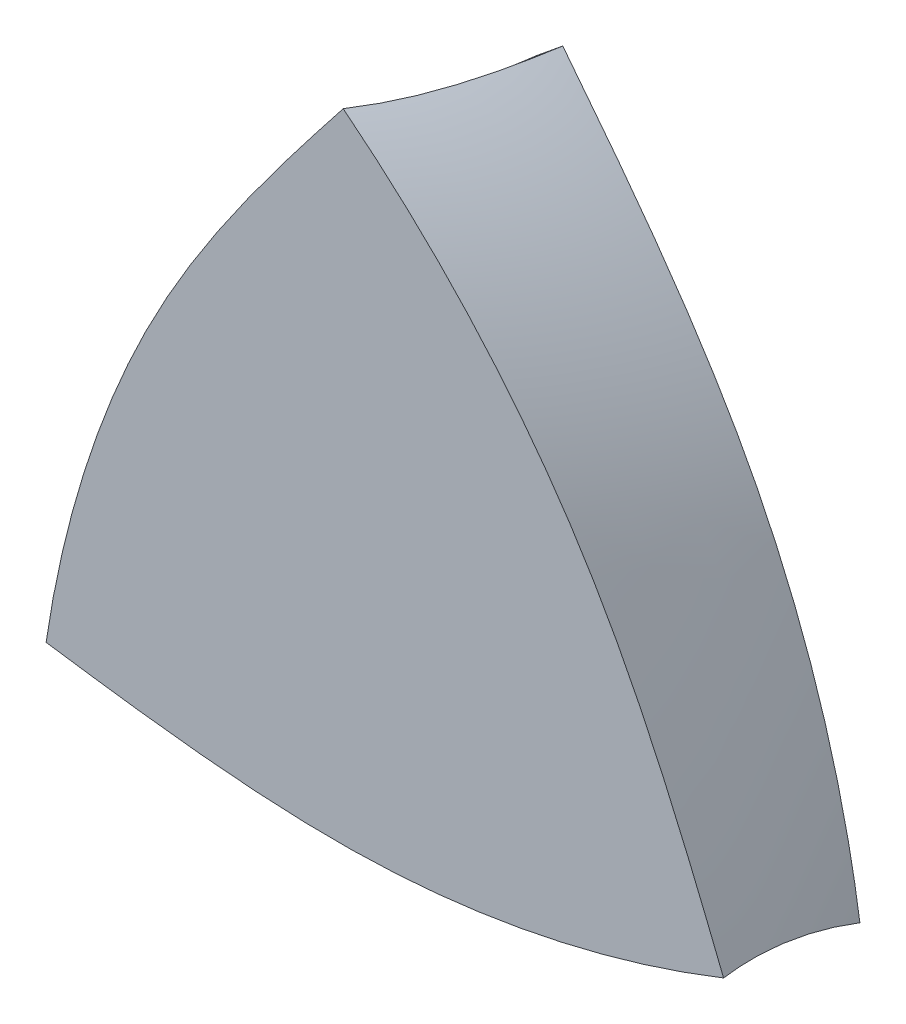
ISO-10303-21;
HEADER;
FILE_DESCRIPTION(('STEP AP214'),'2;1');
FILE_NAME('part.step','',(''),(''),'','','');
FILE_SCHEMA(('AUTOMOTIVE_DESIGN { 1 0 10303 214 1 1 1 1 }'));
ENDSEC;
DATA;
#1=APPLICATION_CONTEXT('core data for automotive mechanical design processes');
#2=APPLICATION_PROTOCOL_DEFINITION('international standard','automotive_design',2000,#1);
#3=PRODUCT_CONTEXT('',#1,'mechanical');
#4=PRODUCT('Part','Part','',(#3));
#5=PRODUCT_RELATED_PRODUCT_CATEGORY('part','',(#4));
#6=PRODUCT_DEFINITION_FORMATION('','',#4);
#7=PRODUCT_DEFINITION_CONTEXT('part definition',#1,'design');
#8=PRODUCT_DEFINITION('design','',#6,#7);
#9=PRODUCT_DEFINITION_SHAPE('','',#8);
#10=(LENGTH_UNIT() NAMED_UNIT(*) SI_UNIT(.MILLI.,.METRE.));
#11=(NAMED_UNIT(*) PLANE_ANGLE_UNIT() SI_UNIT($,.RADIAN.));
#12=(NAMED_UNIT(*) SI_UNIT($,.STERADIAN.) SOLID_ANGLE_UNIT());
#13=UNCERTAINTY_MEASURE_WITH_UNIT(LENGTH_MEASURE(1.E-05),#10,'distance_accuracy_value','');
#14=(GEOMETRIC_REPRESENTATION_CONTEXT(3) GLOBAL_UNCERTAINTY_ASSIGNED_CONTEXT((#13)) GLOBAL_UNIT_ASSIGNED_CONTEXT((#10,
#11,#12)) REPRESENTATION_CONTEXT('',''));
#15=CARTESIAN_POINT('',(0.,0.,0.));
#16=DIRECTION('',(0.,0.,1.));
#17=DIRECTION('',(1.,0.,0.));
#18=AXIS2_PLACEMENT_3D('',#15,#16,#17);
#19=CARTESIAN_POINT('',(43.6636484337214,7.79672682481828,-10.));
#20=CARTESIAN_POINT('',(43.6636484337214,13.0009710064401,-6.66666666666667));
#21=CARTESIAN_POINT('',(43.6636484337214,18.205215188062,-3.33333333333333));
#22=CARTESIAN_POINT('',(43.6636484337214,23.4094593696838,0.));
#23=CARTESIAN_POINT('',(41.8091368690855,6.95225488130662,-10.));
#24=CARTESIAN_POINT('',(42.1474337394217,11.7866400378459,-6.66666666666667));
#25=CARTESIAN_POINT('',(42.4857306097579,16.6210251943851,-3.33333333333333));
#26=CARTESIAN_POINT('',(42.8240274800942,21.4554103509244,0.));
#27=CARTESIAN_POINT('',(38.0459871952282,5.4938957001926,-10.));
#28=CARTESIAN_POINT('',(38.9526212926106,9.62526642299005,-6.66666666666667));
#29=CARTESIAN_POINT('',(39.859255389993,13.7566371457875,-3.33333333333333));
#30=CARTESIAN_POINT('',(40.7658894873754,17.8880078685849,0.));
#31=CARTESIAN_POINT('',(32.2710243796835,3.85854749725558,-10.));
#32=CARTESIAN_POINT('',(33.7632164882088,7.0524480619357,-6.66666666666667));
#33=CARTESIAN_POINT('',(35.2554085967341,10.2463486266158,-3.33333333333334));
#34=CARTESIAN_POINT('',(36.7476007052594,13.4402491912959,0.));
#35=CARTESIAN_POINT('',(27.375608373222,2.83954459980662,-9.99999999999999));
#36=CARTESIAN_POINT('',(29.1823578245888,5.35555616142208,-6.66666666666666));
#37=CARTESIAN_POINT('',(30.9891072759556,7.87156772303755,-3.33333333333333));
#38=CARTESIAN_POINT('',(32.7958567273225,10.387579284653,0.));
#39=CARTESIAN_POINT('',(23.4260593359002,2.1606375824453,-10.));
#40=CARTESIAN_POINT('',(25.4088000947673,4.19980365426195,-6.66666666666667));
#41=CARTESIAN_POINT('',(27.3915408536343,6.2389697260786,-3.33333333333334));
#42=CARTESIAN_POINT('',(29.3742816125014,8.27813579789525,0.));
#43=CARTESIAN_POINT('',(20.4506235997845,1.70278127501915,-9.99999999999999));
#44=CARTESIAN_POINT('',(22.5352925752152,3.41770952249925,-6.66666666666666));
#45=CARTESIAN_POINT('',(24.619961550646,5.13263776997936,-3.33333333333333));
#46=CARTESIAN_POINT('',(26.7046305260768,6.84756601745946,0.));
#47=CARTESIAN_POINT('',(17.4666157694044,1.27649195155378,-10.));
#48=CARTESIAN_POINT('',(19.630453814693,2.70221986337268,-6.66666666666667));
#49=CARTESIAN_POINT('',(21.7942918599817,4.12794777519159,-3.33333333333334));
#50=CARTESIAN_POINT('',(23.9581299052703,5.55367568701049,0.));
#51=CARTESIAN_POINT('',(14.4768670451849,0.872648508679386,-10.));
#52=CARTESIAN_POINT('',(16.7028138218468,2.04311892770188,-6.66666666666667));
#53=CARTESIAN_POINT('',(18.9287605985088,3.21358934672437,-3.33333333333333));
#54=CARTESIAN_POINT('',(21.1547073751707,4.38405976574686,0.));
#55=CARTESIAN_POINT('',(11.4824184568218,0.5167917397322,-10.));
#56=CARTESIAN_POINT('',(13.7555244363946,1.45939251130821,-6.66666666666667));
#57=CARTESIAN_POINT('',(16.0286304159674,2.40199328288421,-3.33333333333333));
#58=CARTESIAN_POINT('',(18.3017363955402,3.34459405446022,0.));
#59=CARTESIAN_POINT('',(7.48389260608912,0.133572459474264,-10.));
#60=CARTESIAN_POINT('',(9.80281451396992,0.800892912905045,-6.66666666666667));
#61=CARTESIAN_POINT('',(12.1217364218507,1.46821336633583,-3.33333333333334));
#62=CARTESIAN_POINT('',(14.4406583297315,2.13553381976661,0.));
#63=CARTESIAN_POINT('',(3.48046155924847,-0.0698272029108238,-9.99999999999999));
#64=CARTESIAN_POINT('',(5.82275000085924,0.352400300121043,-6.66666666666666));
#65=CARTESIAN_POINT('',(8.16503844247001,0.77462780315291,-3.33333333333333));
#66=CARTESIAN_POINT('',(10.5073268840808,1.19685530618478,0.));
#67=CARTESIAN_POINT('',(-0.527727588665591,-0.00582537456174324,-10.));
#68=CARTESIAN_POINT('',(1.82479842776619,0.176585163855678,-6.66666666666668));
#69=CARTESIAN_POINT('',(4.17732444419796,0.3589957022731,-3.33333333333334));
#70=CARTESIAN_POINT('',(6.52985046062974,0.541406240690522,0.));
#71=CARTESIAN_POINT('',(-3.53223350838958,0.194207082682894,-9.99999999999998));
#72=CARTESIAN_POINT('',(-1.17740674845463,0.194207602923751,-6.66666666666666));
#73=CARTESIAN_POINT('',(1.17742001148033,0.194208123164609,-3.33333333333333));
#74=CARTESIAN_POINT('',(3.53224677141529,0.194208643405466,0.));
#75=CARTESIAN_POINT('',(-6.52984510893819,0.541406117537802,-9.99999999999999));
#76=CARTESIAN_POINT('',(-4.17732246334259,0.358995653607832,-6.66666666666666));
#77=CARTESIAN_POINT('',(-1.82479981774699,0.176585189677862,-3.33333333333333));
#78=CARTESIAN_POINT('',(0.527722827848609,-0.00582527425210832,0.));
#79=CARTESIAN_POINT('',(-10.5073372772592,1.19685693066428,-10.));
#80=CARTESIAN_POINT('',(-8.16505073667727,0.77462846196448,-6.66666666666668));
#81=CARTESIAN_POINT('',(-5.82276419609529,0.352399993264677,-3.33333333333334));
#82=CARTESIAN_POINT('',(-3.48047765551331,-0.0698284754351261,0.));
#83=CARTESIAN_POINT('',(-14.4406481866999,2.13553088853004,-9.99999999999999));
#84=CARTESIAN_POINT('',(-12.1217336536134,1.4682123345911,-6.66666666666666));
#85=CARTESIAN_POINT('',(-9.80281912052685,0.800893780652153,-3.33333333333333));
#86=CARTESIAN_POINT('',(-7.48390458744035,0.133575226713211,0.));
#87=CARTESIAN_POINT('',(-18.3017413397137,3.34459620104712,-10.));
#88=CARTESIAN_POINT('',(-16.0286387349578,2.40199481559078,-6.66666666666667));
#89=CARTESIAN_POINT('',(-13.7555361302018,1.45939343013445,-3.33333333333333));
#90=CARTESIAN_POINT('',(-11.4824335254459,0.516792044678117,0.));
#91=CARTESIAN_POINT('',(-21.1547205402237,4.38406431952494,-10.));
#92=CARTESIAN_POINT('',(-18.9287657753661,3.21359227537594,-6.66666666666667));
#93=CARTESIAN_POINT('',(-16.7028110105086,2.04312023122694,-3.33333333333334));
#94=CARTESIAN_POINT('',(-14.476856245651,0.872648187077933,0.));
#95=CARTESIAN_POINT('',(-23.958127290446,5.55367502885713,-9.99999999999998));
#96=CARTESIAN_POINT('',(-21.7942920387565,4.12794737755698,-6.66666666666666));
#97=CARTESIAN_POINT('',(-19.630456787067,2.70221972625683,-3.33333333333333));
#98=CARTESIAN_POINT('',(-17.4666215353775,1.27649207495667,0.));
#99=CARTESIAN_POINT('',(-26.704614154041,6.84755772516819,-10.));
#100=CARTESIAN_POINT('',(-24.6199499836531,5.13263226837063,-6.66666666666667));
#101=CARTESIAN_POINT('',(-22.5352858132653,3.41770681157307,-3.33333333333334));
#102=CARTESIAN_POINT('',(-20.4506216428774,1.70278135477551,0.));
#103=CARTESIAN_POINT('',(-29.3742739629689,8.27813183597963,-10.));
#104=CARTESIAN_POINT('',(-27.3915360166718,6.23896707360427,-6.66666666666667));
#105=CARTESIAN_POINT('',(-25.4087980703747,4.19980231122892,-3.33333333333334));
#106=CARTESIAN_POINT('',(-23.4260601240777,2.16063754885356,0.));
#107=CARTESIAN_POINT('',(-32.7958659317131,10.3875840323535,-9.99999999999998));
#108=CARTESIAN_POINT('',(-30.9891091901021,7.87157014169564,-6.66666666666666));
#109=CARTESIAN_POINT('',(-29.1823524484911,5.35555625103777,-3.33333333333333));
#110=CARTESIAN_POINT('',(-27.3755957068801,2.8395423603799,0.));
#111=CARTESIAN_POINT('',(-36.747594367462,13.4402459239148,-10.));
#112=CARTESIAN_POINT('',(-35.2554063609005,10.2463468005596,-6.66666666666668));
#113=CARTESIAN_POINT('',(-33.763218354339,7.05244767720442,-3.33333333333334));
#114=CARTESIAN_POINT('',(-32.2710303477775,3.85854855384924,0.));
#115=CARTESIAN_POINT('',(-40.7658929668134,17.8880096621788,-9.99999999999999));
#116=CARTESIAN_POINT('',(-39.8592567118938,13.756638164839,-6.66666666666666));
#117=CARTESIAN_POINT('',(-38.9526204569741,9.6252666674993,-3.33333333333333));
#118=CARTESIAN_POINT('',(-38.0459842020544,5.49389517015956,0.));
#119=CARTESIAN_POINT('',(-42.8240274800942,21.4554103509244,-10.));
#120=CARTESIAN_POINT('',(-42.4857306097579,16.6210251943851,-6.66666666666667));
#121=CARTESIAN_POINT('',(-42.1474337394217,11.7866400378459,-3.33333333333333));
#122=CARTESIAN_POINT('',(-41.8091368690855,6.95225488130662,0.));
#123=CARTESIAN_POINT('',(-43.6636484337214,23.4094593696838,-10.));
#124=CARTESIAN_POINT('',(-43.6636484337214,18.205215188062,-6.66666666666667));
#125=CARTESIAN_POINT('',(-43.6636484337214,13.0009710064401,-3.33333333333333));
#126=CARTESIAN_POINT('',(-43.6636484337214,7.79672682481828,0.));
#127=B_SPLINE_SURFACE_WITH_KNOTS('',3,3,((#19,#20,#21,#22),(#23,#24,#25,#26),(#27,#28,#29,#30),
(#31,#32,#33,#34),(#35,#36,#37,#38),(#39,#40,#41,#42),(#43,#44,#45,#46),(#47,#48,#49,#50),(#51,
#52,#53,#54),(#55,#56,#57,#58),(#59,#60,#61,#62),(#63,#64,#65,#66),(#67,#68,#69,#70),(#71,#72,
#73,#74),(#75,#76,#77,#78),(#79,#80,#81,#82),(#83,#84,#85,#86),(#87,#88,#89,#90),(#91,#92,#93,
#94),(#95,#96,#97,#98),(#99,#100,#101,#102),(#103,#104,#105,#106),(#107,#108,#109,#110),(#111,
#112,#113,#114),(#115,#116,#117,#118),(#119,#120,#121,#122),(#123,#124,#125,#126)),
.UNSPECIFIED.,.F.,.F.,.F.,(4,1,1,1,1,1,1,1,1,1,1,1,1,1,1,1,1,1,1,1,1,1,1,1,4),(4,4),(0.,0.0625,
0.125,0.1875,0.21875,0.25,0.28125,0.3125,0.34375,0.375,0.4375,0.46875,0.5,0.53125,0.5625,0.625,
0.65625,0.6875,0.71875,0.75,0.78125,0.8125,0.875,0.9375,1.),(0.,1.),.UNSPECIFIED.);
#128=CARTESIAN_POINT('',(43.6636484337214,7.79672682481828,-10.));
#129=CARTESIAN_POINT('',(41.8091368690855,6.95225488130662,-10.));
#130=CARTESIAN_POINT('',(38.0459871952282,5.4938957001926,-10.));
#131=CARTESIAN_POINT('',(32.2710243796835,3.85854749725558,-10.));
#132=CARTESIAN_POINT('',(27.375608373222,2.83954459980662,-9.99999999999999));
#133=CARTESIAN_POINT('',(23.4260593359002,2.1606375824453,-10.));
#134=CARTESIAN_POINT('',(20.4506235997845,1.70278127501915,-9.99999999999999));
#135=CARTESIAN_POINT('',(17.4666157694044,1.27649195155378,-10.));
#136=CARTESIAN_POINT('',(14.4768670451849,0.872648508679386,-10.));
#137=CARTESIAN_POINT('',(11.4824184568218,0.5167917397322,-10.));
#138=CARTESIAN_POINT('',(7.48389260608912,0.133572459474264,-10.));
#139=CARTESIAN_POINT('',(3.48046155924847,-0.0698272029108238,-9.99999999999999));
#140=CARTESIAN_POINT('',(-0.527727588665591,-0.00582537456174324,-10.));
#141=CARTESIAN_POINT('',(-3.53223350838958,0.194207082682894,-9.99999999999998));
#142=CARTESIAN_POINT('',(-6.52984510893819,0.541406117537802,-9.99999999999999));
#143=CARTESIAN_POINT('',(-10.5073372772592,1.19685693066428,-10.));
#144=CARTESIAN_POINT('',(-14.4406481866999,2.13553088853004,-9.99999999999999));
#145=CARTESIAN_POINT('',(-18.3017413397137,3.34459620104712,-10.));
#146=CARTESIAN_POINT('',(-21.1547205402237,4.38406431952494,-10.));
#147=CARTESIAN_POINT('',(-23.958127290446,5.55367502885713,-9.99999999999998));
#148=CARTESIAN_POINT('',(-26.704614154041,6.84755772516819,-10.));
#149=CARTESIAN_POINT('',(-29.3742739629689,8.27813183597963,-10.));
#150=CARTESIAN_POINT('',(-32.7958659317131,10.3875840323535,-9.99999999999998));
#151=CARTESIAN_POINT('',(-36.747594367462,13.4402459239148,-10.));
#152=CARTESIAN_POINT('',(-40.7658929668134,17.8880096621788,-9.99999999999999));
#153=CARTESIAN_POINT('',(-42.8240274800942,21.4554103509244,-10.));
#154=CARTESIAN_POINT('',(-43.6636484337214,23.4094593696838,-10.));
#155=B_SPLINE_CURVE_WITH_KNOTS('',3,(#128,#129,#130,#131,#132,#133,#134,#135,#136,#137,#138,
#139,#140,#141,#142,#143,#144,#145,#146,#147,#148,#149,#150,#151,#152,#153,#154),.UNSPECIFIED.,
.F.,.F.,(4,1,1,1,1,1,1,1,1,1,1,1,1,1,1,1,1,1,1,1,1,1,1,1,4),(0.,0.0625,0.125,0.1875,0.21875,
0.25,0.28125,0.3125,0.34375,0.375,0.4375,0.46875,0.5,0.53125,0.5625,0.625,0.65625,0.6875,
0.71875,0.75,0.78125,0.8125,0.875,0.9375,1.),.UNSPECIFIED.);
#156=CARTESIAN_POINT('',(19.8035556262651,1.6130093600467,-10.));
#157=VERTEX_POINT('',#156);
#158=CARTESIAN_POINT('',(-21.4952517875645,4.54311306237576,-10.));
#159=VERTEX_POINT('',#158);
#160=EDGE_CURVE('E109',#157,#159,#155,.T.);
#161=CARTESIAN_POINT('',(19.8035556262663,1.61300936003848,-10.));
#162=CARTESIAN_POINT('',(19.8127803050784,1.73267020118532,-9.70758856088589));
#163=CARTESIAN_POINT('',(19.8246789586347,1.84860389186234,-9.41373555480601));
#164=CARTESIAN_POINT('',(19.8544525267976,2.07331831488117,-8.82360168733927));
#165=CARTESIAN_POINT('',(19.8723275456709,2.18209892238702,-8.52732078368206));
#166=CARTESIAN_POINT('',(19.9146751267886,2.39277078106098,-7.93289140122083));
#167=CARTESIAN_POINT('',(19.9391455839506,2.49466421746812,-7.63474354790218));
#168=CARTESIAN_POINT('',(19.9952690543312,2.69203104024906,-7.03701721439146));
#169=CARTESIAN_POINT('',(20.0269219287256,2.78750455066319,-6.73743876196007));
#170=CARTESIAN_POINT('',(20.1259024157179,3.04530347634159,-5.90137621729293));
#171=CARTESIAN_POINT('',(20.2017092444872,3.20115525042524,-5.36386413239777));
#172=CARTESIAN_POINT('',(20.3806418894065,3.4976588424836,-4.28920775652011));
#173=CARTESIAN_POINT('',(20.4837669530237,3.63831107900833,-3.75206345581488));
#174=CARTESIAN_POINT('',(20.6608611536421,3.84180220502397,-2.94588238372255));
#175=CARTESIAN_POINT('',(20.7240688881286,3.90875819024028,-2.67547654886227));
#176=CARTESIAN_POINT('',(20.8579859248366,4.04038103784401,-2.13595893126895));
#177=CARTESIAN_POINT('',(20.928695267255,4.10504788796281,-1.86684715547811));
#178=CARTESIAN_POINT('',(21.0776751797315,4.23263591655614,-1.33024175444438));
#179=CARTESIAN_POINT('',(21.1559474545754,4.29555669730971,-1.06274850854698));
#180=CARTESIAN_POINT('',(21.3199891731726,4.42014643641934,-0.529778467294973));
#181=CARTESIAN_POINT('',(21.4057585739348,4.48181540195125,-0.264301660386878));
#182=CARTESIAN_POINT('',(21.4952516669856,4.54311334466679,0.));
#183=B_SPLINE_CURVE_WITH_KNOTS('',3,(#161,#162,#163,#164,#165,#166,#167,#168,#169,#170,#171,
#172,#173,#174,#175,#176,#177,#178,#179,#180,#181,#182),.UNSPECIFIED.,.F.,.F.,(4,2,2,2,2,2,2,2,
2,2,4),(0.,0.948212484109258,1.89644151207949,2.84436824908989,3.79227666580343,
5.48565186096965,7.17898041373537,8.03584651816049,8.89271721426622,9.74978151306753,
10.6068408974821),.UNSPECIFIED.);
#184=CARTESIAN_POINT('',(21.4952516669856,4.54311334466679,0.));
#185=VERTEX_POINT('',#184);
#186=EDGE_CURVE('E130',#157,#185,#183,.T.);
#187=CARTESIAN_POINT('',(43.6636484337214,23.4094593696838,0.));
#188=CARTESIAN_POINT('',(42.8240274800942,21.4554103509244,0.));
#189=CARTESIAN_POINT('',(40.7658894873754,17.8880078685849,0.));
#190=CARTESIAN_POINT('',(36.7476007052594,13.4402491912959,0.));
#191=CARTESIAN_POINT('',(32.7958567273225,10.387579284653,0.));
#192=CARTESIAN_POINT('',(29.3742816125014,8.27813579789525,0.));
#193=CARTESIAN_POINT('',(26.7046305260768,6.84756601745946,0.));
#194=CARTESIAN_POINT('',(23.9581299052703,5.55367568701049,0.));
#195=CARTESIAN_POINT('',(21.1547073751707,4.38405976574686,0.));
#196=CARTESIAN_POINT('',(18.3017363955402,3.34459405446022,0.));
#197=CARTESIAN_POINT('',(14.4406583297315,2.13553381976661,0.));
#198=CARTESIAN_POINT('',(10.5073268840808,1.19685530618478,0.));
#199=CARTESIAN_POINT('',(6.52985046062974,0.541406240690522,0.));
#200=CARTESIAN_POINT('',(3.53224677141529,0.194208643405466,0.));
#201=CARTESIAN_POINT('',(0.527722827848609,-0.00582527425210832,0.));
#202=CARTESIAN_POINT('',(-3.48047765551331,-0.0698284754351261,0.));
#203=CARTESIAN_POINT('',(-7.48390458744035,0.133575226713211,0.));
#204=CARTESIAN_POINT('',(-11.4824335254459,0.516792044678117,0.));
#205=CARTESIAN_POINT('',(-14.476856245651,0.872648187077933,0.));
#206=CARTESIAN_POINT('',(-17.4666215353775,1.27649207495667,0.));
#207=CARTESIAN_POINT('',(-20.4506216428774,1.70278135477551,0.));
#208=CARTESIAN_POINT('',(-23.4260601240777,2.16063754885356,0.));
#209=CARTESIAN_POINT('',(-27.3755957068801,2.8395423603799,0.));
#210=CARTESIAN_POINT('',(-32.2710303477775,3.85854855384924,0.));
#211=CARTESIAN_POINT('',(-38.0459842020544,5.49389517015956,0.));
#212=CARTESIAN_POINT('',(-41.8091368690855,6.95225488130662,0.));
#213=CARTESIAN_POINT('',(-43.6636484337214,7.79672682481828,0.));
#214=B_SPLINE_CURVE_WITH_KNOTS('',3,(#187,#188,#189,#190,#191,#192,#193,#194,#195,#196,#197,
#198,#199,#200,#201,#202,#203,#204,#205,#206,#207,#208,#209,#210,#211,#212,#213),.UNSPECIFIED.,
.F.,.F.,(4,1,1,1,1,1,1,1,1,1,1,1,1,1,1,1,1,1,1,1,1,1,1,1,4),(0.,0.0625,0.125,0.1875,0.21875,
0.25,0.28125,0.3125,0.34375,0.375,0.4375,0.46875,0.5,0.53125,0.5625,0.625,0.65625,0.6875,
0.71875,0.75,0.78125,0.8125,0.875,0.9375,1.),.UNSPECIFIED.);
#215=CARTESIAN_POINT('',(-19.803555321506,1.61300932331712,0.));
#216=VERTEX_POINT('',#215);
#217=EDGE_CURVE('E83',#185,#216,#214,.T.);
#218=CARTESIAN_POINT('',(-19.803555321506,1.61300932331712,0.));
#219=CARTESIAN_POINT('',(-19.8127801312658,1.7326700373955,-0.292411465418742));
#220=CARTESIAN_POINT('',(-19.8246789065701,1.84860361942362,-0.586264486993908));
#221=CARTESIAN_POINT('',(-19.854452681558,2.07331786859712,-1.17639836635864));
#222=CARTESIAN_POINT('',(-19.8723277855035,2.18209841091218,-1.47267926641657));
#223=CARTESIAN_POINT('',(-19.9146754831923,2.39277019632651,-2.06710864491703));
#224=CARTESIAN_POINT('',(-19.9391459723014,2.49466362420149,-2.36525649800738));
#225=CARTESIAN_POINT('',(-19.9952694469053,2.69203047255155,-2.9629828232156));
#226=CARTESIAN_POINT('',(-20.0269222935847,2.78750401705916,-3.26256126757453));
#227=CARTESIAN_POINT('',(-20.1259026229193,3.04530307659358,-4.09862378293292));
#228=CARTESIAN_POINT('',(-20.2017092588454,3.2011549830879,-4.63613584710888));
#229=CARTESIAN_POINT('',(-20.380641517485,3.4976587784951,-5.71079219976909));
#230=CARTESIAN_POINT('',(-20.4837663868698,3.63831108640218,-6.24793649798543));
#231=CARTESIAN_POINT('',(-20.6608604486629,3.84180224208255,-7.05411757855657));
#232=CARTESIAN_POINT('',(-20.7240681653235,3.9087582262914,-7.32452342804815));
#233=CARTESIAN_POINT('',(-20.8579852226292,4.04038104848899,-7.864041066614));
#234=CARTESIAN_POINT('',(-20.9286946034787,4.10504787420679,-8.13315284874479));
#235=CARTESIAN_POINT('',(-21.0776746532415,4.23263584130747,-8.66975826386897));
#236=CARTESIAN_POINT('',(-21.1559470273846,4.29555658486505,-8.93725151741775));
#237=CARTESIAN_POINT('',(-21.319988989335,4.42014624222962,-9.47022155797981));
#238=CARTESIAN_POINT('',(-21.4057585341414,4.48181516321406,-9.73569835654919));
#239=CARTESIAN_POINT('',(-21.4952517875645,4.54311306237576,-10.));
#240=B_SPLINE_CURVE_WITH_KNOTS('',3,(#218,#219,#220,#221,#222,#223,#224,#225,#226,#227,#228,
#229,#230,#231,#232,#233,#234,#235,#236,#237,#238,#239),.UNSPECIFIED.,.F.,.F.,(4,2,2,2,2,2,2,2,
2,2,4),(0.,0.948212423727866,1.89644139066889,2.84436812855672,3.79227654717841,
5.48565172197648,7.17898020505061,8.03584633678986,8.89271706103343,9.74978143695332,
10.6068408974188),.UNSPECIFIED.);
#241=EDGE_CURVE('E116',#216,#159,#240,.T.);
#242=ORIENTED_EDGE('',*,*,#160,.F.);
#243=ORIENTED_EDGE('',*,*,#186,.T.);
#244=ORIENTED_EDGE('',*,*,#217,.T.);
#245=ORIENTED_EDGE('',*,*,#241,.T.);
#246=EDGE_LOOP('',(#242,#243,#244,#245));
#247=FACE_BOUND('',#246,.T.);
#248=ADVANCED_FACE('F70',(#247),#127,.F.);
#249=CARTESIAN_POINT('',(0.,0.,-10.));
#250=DIRECTION('',(0.,0.,1.));
#251=DIRECTION('',(1.,0.,0.));
#252=AXIS2_PLACEMENT_3D('',#249,#250,#251);
#253=PLANE('',#252);
#254=ORIENTED_EDGE('',*,*,#160,.T.);
#255=CARTESIAN_POINT('',(-28.0700417769672,-19.2121921779244,-10.));
#256=CARTESIAN_POINT('',(-27.8741201505136,-17.1839020795818,-10.));
#257=CARTESIAN_POINT('',(-27.2555214122719,-13.1957392732213,-10.));
#258=CARTESIAN_POINT('',(-25.7842930922762,-7.37680066758052,-10.));
#259=CARTESIAN_POINT('',(-24.2190674847662,-2.6277445951674,-9.99999999999999));
#260=CARTESIAN_POINT('',(-22.8322436899477,1.13211871332627,-10.));
#261=CARTESIAN_POINT('',(-21.7410410154038,3.93784980184362,-9.99999999999999));
#262=CARTESIAN_POINT('',(-20.6182144836969,6.73522104977712,-10.));
#263=CARTESIAN_POINT('',(-19.4730788022681,9.52634111732049,-10.));
#264=CARTESIAN_POINT('',(-18.2840355101034,12.297538049643,-10.));
#265=CARTESIAN_POINT('',(-16.6166502166605,15.9519726541952,-10.));
#266=CARTESIAN_POINT('',(-14.7910839679868,19.5207454742511,-9.99999999999999));
#267=CARTESIAN_POINT('',(-12.7315621847908,22.9599381853432,-10.));
#268=CARTESIAN_POINT('',(-11.0560760353735,25.4619004090226,-9.99999999999998));
#269=CARTESIAN_POINT('',(-9.25658705074539,27.8843086883492,-9.99999999999999));
#270=CARTESIAN_POINT('',(-6.70020391148614,31.0011925429056,-10.));
#271=CARTESIAN_POINT('',(-3.9206329633832,33.9382027325308,-9.99999999999999));
#272=CARTESIAN_POINT('',(-0.943005111401883,36.6774748331604,-10.));
#273=CARTESIAN_POINT('',(1.3836902858789,38.6284932380317,-10.));
#274=CARTESIAN_POINT('',(3.7983062478101,40.4715093461989,-9.99999999999998));
#275=CARTESIAN_POINT('',(6.29208496413007,42.2030953930769,-10.));
#276=CARTESIAN_POINT('',(8.86582839055308,43.799801551665,-10.));
#277=CARTESIAN_POINT('',(12.4034635650538,45.7082610197953,-9.99999999999998));
#278=CARTESIAN_POINT('',(17.023010530185,47.6042272882306,-10.));
#279=CARTESIAN_POINT('',(22.8840362172286,48.8602940861283,-9.99999999999999));
#280=CARTESIAN_POINT('',(27.0025630958008,48.8589905146621,-10.));
#281=CARTESIAN_POINT('',(29.1146296631001,48.6090990806733,-10.));
#282=B_SPLINE_CURVE_WITH_KNOTS('',3,(#255,#256,#257,#258,#259,#260,#261,#262,#263,#264,#265,
#266,#267,#268,#269,#270,#271,#272,#273,#274,#275,#276,#277,#278,#279,#280,#281),.UNSPECIFIED.,
.F.,.F.,(4,1,1,1,1,1,1,1,1,1,1,1,1,1,1,1,1,1,1,1,1,1,1,1,4),(0.,0.0625,0.125,0.1875,0.21875,
0.25,0.28125,0.3125,0.34375,0.375,0.4375,0.46875,0.5,0.53125,0.5625,0.625,0.65625,0.6875,
0.71875,0.75,0.78125,0.8125,0.875,0.9375,1.),.UNSPECIFIED.);
#283=CARTESIAN_POINT('',(1.69169616129809,38.8438775775858,-10.));
#284=VERTEX_POINT('',#283);
#285=EDGE_CURVE('E90',#159,#284,#282,.T.);
#286=ORIENTED_EDGE('',*,*,#285,.T.);
#287=CARTESIAN_POINT('',(-15.5936066567539,56.4154653531063,-10.));
#288=CARTESIAN_POINT('',(-13.9350167185717,55.2316471982755,-10.));
#289=CARTESIAN_POINT('',(-10.7904657829561,52.7018435730289,-10.));
#290=CARTESIAN_POINT('',(-6.48673128740705,48.5182531703251,-10.));
#291=CARTESIAN_POINT('',(-3.15654088845557,44.7881999953609,-9.99999999999999));
#292=CARTESIAN_POINT('',(-0.593815645952296,41.7072437042285,-10.));
#293=CARTESIAN_POINT('',(1.29041741561954,39.3593689231373,-9.99999999999999));
#294=CARTESIAN_POINT('',(3.15159871429264,36.9882869986692,-10.));
#295=CARTESIAN_POINT('',(4.99621175708334,34.6010103740002,-10.));
#296=CARTESIAN_POINT('',(6.80161705328182,32.1856702106248,-10.));
#297=CARTESIAN_POINT('',(9.13275761057147,28.9144548863305,-10.));
#298=CARTESIAN_POINT('',(11.3106224087384,25.5490817286597,-9.99999999999999));
#299=CARTESIAN_POINT('',(13.2592897734565,22.0458871892184,-10.));
#300=CARTESIAN_POINT('',(14.5883095437632,19.3438925082944,-9.99999999999998));
#301=CARTESIAN_POINT('',(15.7864321596836,16.5742851941129,-9.99999999999999));
#302=CARTESIAN_POINT('',(17.2075411887454,12.80195052643,-10.));
#303=CARTESIAN_POINT('',(18.3612811500831,8.92626637893905,-9.99999999999999));
#304=CARTESIAN_POINT('',(19.2447464511156,4.97792896579232,-10.));
#305=CARTESIAN_POINT('',(19.7710302543448,1.98744244244318,-10.));
#306=CARTESIAN_POINT('',(20.1598210426359,-1.02518437505625,-9.99999999999998));
#307=CARTESIAN_POINT('',(20.4125291899109,-4.05065311824526,-10.));
#308=CARTESIAN_POINT('',(20.5084455724158,-7.07793338764487,-10.));
#309=CARTESIAN_POINT('',(20.3924023666591,-11.0958450521491,-9.99999999999998));
#310=CARTESIAN_POINT('',(19.7245838372768,-16.0444732121456,-10.));
#311=CARTESIAN_POINT('',(17.8818567495846,-21.7483037483074,-9.99999999999999));
#312=CARTESIAN_POINT('',(15.8214643842931,-25.3144008655868,-10.));
#313=CARTESIAN_POINT('',(14.5490187706211,-27.0185584503574,-10.));
#314=B_SPLINE_CURVE_WITH_KNOTS('',3,(#287,#288,#289,#290,#291,#292,#293,#294,#295,#296,#297,
#298,#299,#300,#301,#302,#303,#304,#305,#306,#307,#308,#309,#310,#311,#312,#313),.UNSPECIFIED.,
.F.,.F.,(4,1,1,1,1,1,1,1,1,1,1,1,1,1,1,1,1,1,1,1,1,1,1,1,4),(0.,0.0625,0.125,0.1875,0.21875,
0.25,0.28125,0.3125,0.34375,0.375,0.4375,0.46875,0.5,0.53125,0.5625,0.625,0.65625,0.6875,
0.71875,0.75,0.78125,0.8125,0.875,0.9375,1.),.UNSPECIFIED.);
#315=EDGE_CURVE('E112',#284,#157,#314,.T.);
#316=ORIENTED_EDGE('',*,*,#315,.T.);
#317=EDGE_LOOP('',(#254,#286,#316));
#318=FACE_BOUND('',#317,.T.);
#319=ADVANCED_FACE('F111',(#318),#253,.F.);
#320=CARTESIAN_POINT('',(0.,0.,0.));
#321=DIRECTION('',(0.,0.,1.));
#322=DIRECTION('',(1.,0.,0.));
#323=AXIS2_PLACEMENT_3D('',#320,#321,#322);
#324=PLANE('',#323);
#325=ORIENTED_EDGE('',*,*,#217,.F.);
#326=CARTESIAN_POINT('',(-29.1146296630996,48.6090990806737,0.));
#327=CARTESIAN_POINT('',(-27.0025630958003,48.8589905146625,0.));
#328=CARTESIAN_POINT('',(-22.8840329242113,48.8602919696439,0.));
#329=CARTESIAN_POINT('',(-17.0230165287184,47.6042311432338,0.));
#330=CARTESIAN_POINT('',(-12.4034548512289,45.7082554224096,0.));
#331=CARTESIAN_POINT('',(-8.86583564643849,43.7998061953968,0.));
#332=CARTESIAN_POINT('',(-6.29210033148249,42.2031054255302,0.));
#333=CARTESIAN_POINT('',(-3.79830812519942,40.4715112816265,0.));
#334=CARTESIAN_POINT('',(-1.38367975966458,38.6284841136504,0.));
#335=CARTESIAN_POINT('',(0.943009442487751,36.6774716246739,0.));
#336=CARTESIAN_POINT('',(3.92062535334229,33.9382100510355,0.));
#337=CARTESIAN_POINT('',(6.70021051491612,31.0011843543887,0.));
#338=CARTESIAN_POINT('',(9.2565842682464,27.8843132614735,0.));
#339=CARTESIAN_POINT('',(11.0560680522354,25.4619111147784,0.));
#340=CARTESIAN_POINT('',(12.7315644783287,22.9599340121998,0.));
#341=CARTESIAN_POINT('',(14.7910931181576,19.5207321707388,0.));
#342=CARTESIAN_POINT('',(16.6166538108369,15.951960894421,0.));
#343=CARTESIAN_POINT('',(18.2840427803245,12.2975248473585,0.));
#344=CARTESIAN_POINT('',(19.4730736810161,9.52635063079167,0.));
#345=CARTESIAN_POINT('',(20.6182172598133,6.73521599459619,0.));
#346=CARTESIAN_POINT('',(21.7410399678791,3.93785145669637,0.));
#347=CARTESIAN_POINT('',(22.8322441131276,1.13211804754011,0.));
#348=CARTESIAN_POINT('',(24.2190630909954,-2.62773250608055,0.));
#349=CARTESIAN_POINT('',(25.784295161286,-7.37680636439873,0.));
#350=CARTESIAN_POINT('',(27.2555203747067,-13.1957364160406,0.));
#351=CARTESIAN_POINT('',(27.8741201505131,-17.1839020795822,0.));
#352=CARTESIAN_POINT('',(28.0700417769667,-19.2121921779247,0.));
#353=B_SPLINE_CURVE_WITH_KNOTS('',3,(#326,#327,#328,#329,#330,#331,#332,#333,#334,#335,#336,
#337,#338,#339,#340,#341,#342,#343,#344,#345,#346,#347,#348,#349,#350,#351,#352),.UNSPECIFIED.,
.F.,.F.,(4,1,1,1,1,1,1,1,1,1,1,1,1,1,1,1,1,1,1,1,1,1,1,1,4),(0.,0.0625,0.125,0.1875,0.21875,
0.25,0.28125,0.3125,0.34375,0.375,0.4375,0.46875,0.5,0.53125,0.5625,0.625,0.65625,0.6875,
0.71875,0.75,0.78125,0.8125,0.875,0.9375,1.),.UNSPECIFIED.);
#354=CARTESIAN_POINT('',(-1.69169634547972,38.8438773320161,0.));
#355=VERTEX_POINT('',#354);
#356=EDGE_CURVE('E190',#185,#355,#353,.F.);
#357=ORIENTED_EDGE('',*,*,#356,.T.);
#358=CARTESIAN_POINT('',(-14.5490187706217,-27.0185584503572,0.));
#359=CARTESIAN_POINT('',(-15.8214643842937,-25.3144008655866,0.));
#360=CARTESIAN_POINT('',(-17.881856563164,-21.7482998382285,0.));
#361=CARTESIAN_POINT('',(-19.7245841765409,-16.0444803345295,0.));
#362=CARTESIAN_POINT('',(-20.3924018760934,-11.0958347070624,0.));
#363=CARTESIAN_POINT('',(-20.5084459660627,-7.07794199329186,0.));
#364=CARTESIAN_POINT('',(-20.4125301945941,-4.05067144298953,0.));
#365=CARTESIAN_POINT('',(-20.1598217800707,-1.02518696863692,0.));
#366=CARTESIAN_POINT('',(-19.7710276155059,1.98745612060282,0.));
#367=CARTESIAN_POINT('',(-19.2447458380278,4.97793432086594,0.));
#368=CARTESIAN_POINT('',(-18.3612836830737,8.92625612919792,0.));
#369=CARTESIAN_POINT('',(-17.2075373989968,12.8019603394266,0.));
#370=CARTESIAN_POINT('',(-15.786434728876,16.5742804978359,0.));
#371=CARTESIAN_POINT('',(-14.5883148236506,19.3438802418161,0.));
#372=CARTESIAN_POINT('',(-13.2592873061772,22.0458912620523,0.));
#373=CARTESIAN_POINT('',(-11.3106154626442,25.5490963046963,0.));
#374=CARTESIAN_POINT('',(-9.13274922339643,28.9144638788657,0.));
#375=CARTESIAN_POINT('',(-6.80160925487862,32.1856831079632,0.));
#376=CARTESIAN_POINT('',(-4.99621743536506,34.6010011821302,0.));
#377=CARTESIAN_POINT('',(-3.15159572443573,36.988291930447,0.));
#378=CARTESIAN_POINT('',(-1.2904183250017,39.3593671885279,0.));
#379=CARTESIAN_POINT('',(0.593816010950104,41.7072444036061,0.));
#380=CARTESIAN_POINT('',(3.15653261588462,44.7881901457004,0.));
#381=CARTESIAN_POINT('',(6.48673518649146,48.5182578105492,0.));
#382=CARTESIAN_POINT('',(10.7904638273476,52.7018412458807,0.));
#383=CARTESIAN_POINT('',(13.9350167185723,55.2316471982753,0.));
#384=CARTESIAN_POINT('',(15.5936066567545,56.4154653531061,0.));
#385=B_SPLINE_CURVE_WITH_KNOTS('',3,(#358,#359,#360,#361,#362,#363,#364,#365,#366,#367,#368,
#369,#370,#371,#372,#373,#374,#375,#376,#377,#378,#379,#380,#381,#382,#383,#384),.UNSPECIFIED.,
.F.,.F.,(4,1,1,1,1,1,1,1,1,1,1,1,1,1,1,1,1,1,1,1,1,1,1,1,4),(0.,0.0625,0.125,0.1875,0.21875,
0.25,0.28125,0.3125,0.34375,0.375,0.4375,0.46875,0.5,0.53125,0.5625,0.625,0.65625,0.6875,
0.71875,0.75,0.78125,0.8125,0.875,0.9375,1.),.UNSPECIFIED.);
#386=EDGE_CURVE('E98',#355,#216,#385,.F.);
#387=ORIENTED_EDGE('',*,*,#386,.T.);
#388=EDGE_LOOP('',(#325,#357,#387));
#389=FACE_BOUND('',#388,.T.);
#390=ADVANCED_FACE('F72',(#389),#324,.T.);
#391=CARTESIAN_POINT('',(-28.0700417769672,-19.2121921779244,-10.));
#392=CARTESIAN_POINT('',(-23.5630341081854,-21.8143142687353,-6.66666666666667));
#393=CARTESIAN_POINT('',(-19.0560264394035,-24.4164363595462,-3.33333333333333));
#394=CARTESIAN_POINT('',(-14.5490187706217,-27.0185584503572,0.));
#395=CARTESIAN_POINT('',(-27.8741201505136,-17.1839020795818,-10.));
#396=CARTESIAN_POINT('',(-23.8565682284403,-19.8940683415834,-6.66666666666667));
#397=CARTESIAN_POINT('',(-19.839016306367,-22.604234603585,-3.33333333333333));
#398=CARTESIAN_POINT('',(-15.8214643842937,-25.3144008655866,0.));
#399=CARTESIAN_POINT('',(-27.2555214122719,-13.1957392732213,-10.));
#400=CARTESIAN_POINT('',(-24.1309664625693,-16.0465927948903,-6.66666666666667));
#401=CARTESIAN_POINT('',(-21.0064115128666,-18.8974463165594,-3.33333333333333));
#402=CARTESIAN_POINT('',(-17.881856563164,-21.7482998382285,0.));
#403=CARTESIAN_POINT('',(-25.7842930922762,-7.37680066758052,-10.));
#404=CARTESIAN_POINT('',(-23.7643901203644,-10.2660272232302,-6.66666666666667));
#405=CARTESIAN_POINT('',(-21.7444871484527,-13.1552537788798,-3.33333333333334));
#406=CARTESIAN_POINT('',(-19.7245841765409,-16.0444803345295,0.));
#407=CARTESIAN_POINT('',(-24.2190674847662,-2.6277445951674,-9.99999999999999));
#408=CARTESIAN_POINT('',(-22.9435122818753,-5.45044129913242,-6.66666666666666));
#409=CARTESIAN_POINT('',(-21.6679570789843,-8.27313800309743,-3.33333333333333));
#410=CARTESIAN_POINT('',(-20.3924018760934,-11.0958347070624,0.));
#411=CARTESIAN_POINT('',(-22.8322436899477,1.13211871332627,-10.));
#412=CARTESIAN_POINT('',(-22.0576444486527,-1.60456818887977,-6.66666666666667));
#413=CARTESIAN_POINT('',(-21.2830452073577,-4.34125509108581,-3.33333333333334));
#414=CARTESIAN_POINT('',(-20.5084459660627,-7.07794199329186,0.));
#415=CARTESIAN_POINT('',(-21.7410410154038,3.93784980184362,-9.99999999999999));
#416=CARTESIAN_POINT('',(-21.2982040751339,1.27500938689923,-6.66666666666666));
#417=CARTESIAN_POINT('',(-20.855367134864,-1.38783102804515,-3.33333333333333));
#418=CARTESIAN_POINT('',(-20.4125301945941,-4.05067144298953,0.));
#419=CARTESIAN_POINT('',(-20.6182144836969,6.73522104977712,-10.));
#420=CARTESIAN_POINT('',(-20.4654169158215,4.14841837697244,-6.66666666666667));
#421=CARTESIAN_POINT('',(-20.3126193479461,1.56161570416776,-3.33333333333334));
#422=CARTESIAN_POINT('',(-20.1598217800707,-1.02518696863692,0.));
#423=CARTESIAN_POINT('',(-19.4730788022681,9.52634111732049,-10.));
#424=CARTESIAN_POINT('',(-19.5723950733474,7.01337945174793,-6.66666666666667));
#425=CARTESIAN_POINT('',(-19.6717113444267,4.50041778617538,-3.33333333333333));
#426=CARTESIAN_POINT('',(-19.7710276155059,1.98745612060282,0.));
#427=CARTESIAN_POINT('',(-18.2840355101034,12.297538049643,-10.));
#428=CARTESIAN_POINT('',(-18.6042722860782,9.85767014005066,-6.66666666666667));
#429=CARTESIAN_POINT('',(-18.924509062053,7.4178022304583,-3.33333333333333));
#430=CARTESIAN_POINT('',(-19.2447458380278,4.97793432086594,0.));
#431=CARTESIAN_POINT('',(-16.6166502166605,15.9519726541952,-10.));
#432=CARTESIAN_POINT('',(-17.1981947054649,13.6100671458628,-6.66666666666667));
#433=CARTESIAN_POINT('',(-17.7797391942693,11.2681616375304,-3.33333333333334));
#434=CARTESIAN_POINT('',(-18.3612836830737,8.92625612919792,0.));
#435=CARTESIAN_POINT('',(-14.7910839679868,19.5207454742511,-9.99999999999999));
#436=CARTESIAN_POINT('',(-15.5965684449901,17.2811504293096,-6.66666666666666));
#437=CARTESIAN_POINT('',(-16.4020529219934,15.0415553843681,-3.33333333333333));
#438=CARTESIAN_POINT('',(-17.2075373989968,12.8019603394266,0.));
#439=CARTESIAN_POINT('',(-12.7315621847908,22.9599381853432,-10.));
#440=CARTESIAN_POINT('',(-13.7498530328192,20.8313856228408,-6.66666666666668));
#441=CARTESIAN_POINT('',(-14.7681438808476,18.7028330603384,-3.33333333333334));
#442=CARTESIAN_POINT('',(-15.786434728876,16.5742804978359,0.));
#443=CARTESIAN_POINT('',(-11.0560760353735,25.4619004090226,-9.99999999999998));
#444=CARTESIAN_POINT('',(-12.2334889647992,23.4225603532871,-6.66666666666666));
#445=CARTESIAN_POINT('',(-13.4109018942249,21.3832202975516,-3.33333333333333));
#446=CARTESIAN_POINT('',(-14.5883148236506,19.3438802418161,0.));
#447=CARTESIAN_POINT('',(-9.25658705074539,27.8843086883492,-9.99999999999999));
#448=CARTESIAN_POINT('',(-10.5908204692227,25.9381695462502,-6.66666666666666));
#449=CARTESIAN_POINT('',(-11.9250538876999,23.9920304041512,-3.33333333333333));
#450=CARTESIAN_POINT('',(-13.2592873061772,22.0458912620523,0.));
#451=CARTESIAN_POINT('',(-6.70020391148614,31.0011925429056,-10.));
#452=CARTESIAN_POINT('',(-8.23700776187217,29.1838271301692,-6.66666666666668));
#453=CARTESIAN_POINT('',(-9.7738116122582,27.3664617174327,-3.33333333333334));
#454=CARTESIAN_POINT('',(-11.3106154626442,25.5490963046963,0.));
#455=CARTESIAN_POINT('',(-3.9206329633832,33.9382027325308,-9.99999999999999));
#456=CARTESIAN_POINT('',(-5.65800505005428,32.2636231146424,-6.66666666666666));
#457=CARTESIAN_POINT('',(-7.39537713672536,30.589043496754,-3.33333333333333));
#458=CARTESIAN_POINT('',(-9.13274922339643,28.9144638788657,0.));
#459=CARTESIAN_POINT('',(-0.943005111401883,36.6774748331604,-10.));
#460=CARTESIAN_POINT('',(-2.89587315922746,35.1802109247613,-6.66666666666667));
#461=CARTESIAN_POINT('',(-4.84874120705304,33.6829470163623,-3.33333333333333));
#462=CARTESIAN_POINT('',(-6.80160925487862,32.1856831079632,0.));
#463=CARTESIAN_POINT('',(1.3836902858789,38.6284932380317,-10.));
#464=CARTESIAN_POINT('',(-0.742945621202418,37.2859958860645,-6.66666666666667));
#465=CARTESIAN_POINT('',(-2.86958152828374,35.9434985340974,-3.33333333333334));
#466=CARTESIAN_POINT('',(-4.99621743536506,34.6010011821302,0.));
#467=CARTESIAN_POINT('',(3.7983062478101,40.4715093461989,-9.99999999999998));
#468=CARTESIAN_POINT('',(1.48167225706149,39.3104368742816,-6.66666666666666));
#469=CARTESIAN_POINT('',(-0.83496173368712,38.1493644023643,-3.33333333333333));
#470=CARTESIAN_POINT('',(-3.15159572443573,36.988291930447,0.));
#471=CARTESIAN_POINT('',(6.29208496413007,42.2030953930769,-10.));
#472=CARTESIAN_POINT('',(3.76458386775281,41.2551859915605,-6.66666666666667));
#473=CARTESIAN_POINT('',(1.23708277137556,40.3072765900442,-3.33333333333334));
#474=CARTESIAN_POINT('',(-1.2904183250017,39.3593671885279,0.));
#475=CARTESIAN_POINT('',(8.86582839055308,43.799801551665,-10.));
#476=CARTESIAN_POINT('',(6.10849093068542,43.1022825023121,-6.66666666666667));
#477=CARTESIAN_POINT('',(3.35115347081776,42.4047634529591,-3.33333333333334));
#478=CARTESIAN_POINT('',(0.593816010950104,41.7072444036061,0.));
#479=CARTESIAN_POINT('',(12.4034635650538,45.7082610197953,-9.99999999999998));
#480=CARTESIAN_POINT('',(9.3211532486641,45.4015707284304,-6.66666666666666));
#481=CARTESIAN_POINT('',(6.23884293227436,45.0948804370654,-3.33333333333333));
#482=CARTESIAN_POINT('',(3.15653261588462,44.7881901457004,0.));
#483=CARTESIAN_POINT('',(17.023010530185,47.6042272882306,-10.));
#484=CARTESIAN_POINT('',(13.5109187489539,47.9089041290035,-6.66666666666668));
#485=CARTESIAN_POINT('',(9.99882696772266,48.2135809697763,-3.33333333333334));
#486=CARTESIAN_POINT('',(6.48673518649146,48.5182578105492,0.));
#487=CARTESIAN_POINT('',(22.8840362172286,48.8602940861283,-9.99999999999999));
#488=CARTESIAN_POINT('',(18.8528454206016,50.1408098060458,-6.66666666666666));
#489=CARTESIAN_POINT('',(14.8216546239746,51.4213255259632,-3.33333333333333));
#490=CARTESIAN_POINT('',(10.7904638273476,52.7018412458807,0.));
#491=CARTESIAN_POINT('',(27.0025630958008,48.8589905146621,-10.));
#492=CARTESIAN_POINT('',(22.6467143033913,50.9832094091998,-6.66666666666667));
#493=CARTESIAN_POINT('',(18.2908655109818,53.1074283037376,-3.33333333333333));
#494=CARTESIAN_POINT('',(13.9350167185723,55.2316471982753,0.));
#495=CARTESIAN_POINT('',(29.1146296631001,48.6090990806733,-10.));
#496=CARTESIAN_POINT('',(24.6076219943182,51.2112211714843,-6.66666666666667));
#497=CARTESIAN_POINT('',(20.1006143255364,53.8133432622952,-3.33333333333333));
#498=CARTESIAN_POINT('',(15.5936066567545,56.4154653531061,0.));
#499=B_SPLINE_SURFACE_WITH_KNOTS('',3,3,((#391,#392,#393,#394),(#395,#396,#397,#398),(#399,#400,
#401,#402),(#403,#404,#405,#406),(#407,#408,#409,#410),(#411,#412,#413,#414),(#415,#416,#417,
#418),(#419,#420,#421,#422),(#423,#424,#425,#426),(#427,#428,#429,#430),(#431,#432,#433,#434),
(#435,#436,#437,#438),(#439,#440,#441,#442),(#443,#444,#445,#446),(#447,#448,#449,#450),(#451,
#452,#453,#454),(#455,#456,#457,#458),(#459,#460,#461,#462),(#463,#464,#465,#466),(#467,#468,
#469,#470),(#471,#472,#473,#474),(#475,#476,#477,#478),(#479,#480,#481,#482),(#483,#484,#485,
#486),(#487,#488,#489,#490),(#491,#492,#493,#494),(#495,#496,#497,#498)),.UNSPECIFIED.,.F.,.F.,
.F.,(4,1,1,1,1,1,1,1,1,1,1,1,1,1,1,1,1,1,1,1,1,1,1,1,4),(4,4),(0.,0.0625,0.125,0.1875,0.21875,
0.25,0.28125,0.3125,0.34375,0.375,0.4375,0.46875,0.5,0.53125,0.5625,0.625,0.65625,0.6875,
0.71875,0.75,0.78125,0.8125,0.875,0.9375,1.),(0.,1.),.UNSPECIFIED.);
#500=CARTESIAN_POINT('',(-1.69169634547973,38.8438773320161,0.));
#501=CARTESIAN_POINT('',(-1.58345472237292,38.7920358945741,-0.292411465418741));
#502=CARTESIAN_POINT('',(-1.47710390753269,38.7443737452474,-0.586264486993908));
#503=CARTESIAN_POINT('',(-1.26760877166218,38.6578014661667,-1.17639836635864));
#504=CARTESIAN_POINT('',(-1.16446450660712,38.6188914891213,-1.47267926641657));
#505=CARTESIAN_POINT('',(-0.960843539733302,38.5502297784044,-2.06710864491703));
#506=CARTESIAN_POINT('',(-0.860365998160327,38.5204751296784,-2.36525649800738));
#507=CARTESIAN_POINT('',(-0.661379556322374,38.470396060259,-2.9629828232156));
#508=CARTESIAN_POINT('',(-0.562870618049719,38.4500714573317,-3.26256126757453));
#509=CARTESIAN_POINT('',(-0.290119918753899,38.4068914072432,-4.09862378293293));
#510=CARTESIAN_POINT('',(-0.117244890538523,38.3946159264834,-4.63613584710888));
#511=CARTESIAN_POINT('',(0.229001057922427,38.4013239103183,-5.71079219976909));
#512=CARTESIAN_POINT('',(0.402371964363252,38.4203065130139,-6.24793649798543));
#513=CARTESIAN_POINT('',(0.667147505524504,38.471928891546,-7.05411757855657));
#514=CARTESIAN_POINT('',(0.756736947115027,38.4931903877848,-7.32452342804815));
#515=CARTESIAN_POINT('',(0.937684183508811,38.5433545503128,-7.864041066614));
#516=CARTESIAN_POINT('',(1.02904198778726,38.5722572575554,-8.13315284874479));
#517=CARTESIAN_POINT('',(1.21402643339505,38.6374837817567,-8.66975826386897));
#518=CARTESIAN_POINT('',(1.30765358281251,38.6738092744004,-8.93725151741775));
#519=CARTESIAN_POINT('',(1.49757237211419,38.7535789520538,-9.47022155797981));
#520=CARTESIAN_POINT('',(1.59386399671389,38.797023096235,-9.73569835654918));
#521=CARTESIAN_POINT('',(1.69169616129809,38.8438775775858,-10.));
#522=B_SPLINE_CURVE_WITH_KNOTS('',3,(#500,#501,#502,#503,#504,#505,#506,#507,#508,#509,#510,
#511,#512,#513,#514,#515,#516,#517,#518,#519,#520,#521),.UNSPECIFIED.,.F.,.F.,(4,2,2,2,2,2,2,2,
2,2,4),(0.,0.948212423727867,1.89644139066889,2.84436812855672,3.79227654717841,
5.48565172197648,7.17898020505061,8.03584633678986,8.89271706103344,9.74978143695332,
10.6068408974188),.UNSPECIFIED.);
#523=EDGE_CURVE('E14',#355,#284,#522,.T.);
#524=ORIENTED_EDGE('',*,*,#285,.F.);
#525=ORIENTED_EDGE('',*,*,#241,.F.);
#526=ORIENTED_EDGE('',*,*,#386,.F.);
#527=ORIENTED_EDGE('',*,*,#523,.T.);
#528=EDGE_LOOP('',(#524,#525,#526,#527));
#529=FACE_BOUND('',#528,.T.);
#530=ADVANCED_FACE('F121',(#529),#499,.F.);
#531=CARTESIAN_POINT('',(-15.5936066567539,56.4154653531063,-10.));
#532=CARTESIAN_POINT('',(-20.1006143255358,53.8133432622955,-6.66666666666667));
#533=CARTESIAN_POINT('',(-24.6076219943177,51.2112211714846,-3.33333333333333));
#534=CARTESIAN_POINT('',(-29.1146296630996,48.6090990806737,0.));
#535=CARTESIAN_POINT('',(-13.9350167185717,55.2316471982755,-10.));
#536=CARTESIAN_POINT('',(-18.2908655109812,53.1074283037378,-6.66666666666667));
#537=CARTESIAN_POINT('',(-22.6467143033908,50.9832094092001,-3.33333333333333));
#538=CARTESIAN_POINT('',(-27.0025630958003,48.8589905146625,0.));
#539=CARTESIAN_POINT('',(-10.7904657829561,52.7018435730289,-10.));
#540=CARTESIAN_POINT('',(-14.8216548300411,51.4213263719005,-6.66666666666667));
#541=CARTESIAN_POINT('',(-18.8528438771262,50.1408091707722,-3.33333333333333));
#542=CARTESIAN_POINT('',(-22.8840329242113,48.8602919696439,0.));
#543=CARTESIAN_POINT('',(-6.48673128740705,48.5182531703251,-10.));
#544=CARTESIAN_POINT('',(-9.99882636784415,48.2135791612947,-6.66666666666667));
#545=CARTESIAN_POINT('',(-13.5109214482813,47.9089051522642,-3.33333333333334));
#546=CARTESIAN_POINT('',(-17.0230165287184,47.6042311432338,0.));
#547=CARTESIAN_POINT('',(-3.15654088845557,44.7881999953609,-9.99999999999999));
#548=CARTESIAN_POINT('',(-6.23884554271334,45.0948851377105,-6.66666666666666));
#549=CARTESIAN_POINT('',(-9.3211501969711,45.4015702800601,-3.33333333333333));
#550=CARTESIAN_POINT('',(-12.4034548512289,45.7082554224096,0.));
#551=CARTESIAN_POINT('',(-0.593815645952296,41.7072437042285,-10.));
#552=CARTESIAN_POINT('',(-3.35115564611436,42.404764534618,-6.66666666666667));
#553=CARTESIAN_POINT('',(-6.10849564627643,43.1022853650074,-3.33333333333334));
#554=CARTESIAN_POINT('',(-8.86583564643849,43.7998061953968,0.));
#555=CARTESIAN_POINT('',(1.29041741561954,39.3593689231373,-9.99999999999999));
#556=CARTESIAN_POINT('',(-1.23708850008114,40.3072810906016,-6.66666666666666));
#557=CARTESIAN_POINT('',(-3.76459441578181,41.2551932580659,-3.33333333333333));
#558=CARTESIAN_POINT('',(-6.29210033148249,42.2031054255302,0.));
#559=CARTESIAN_POINT('',(3.15159871429264,36.9882869986692,-10.));
#560=CARTESIAN_POINT('',(0.834963101128617,38.149361759655,-6.66666666666667));
#561=CARTESIAN_POINT('',(-1.4816725120354,39.3104365206408,-3.33333333333334));
#562=CARTESIAN_POINT('',(-3.79830812519942,40.4715112816265,0.));
#563=CARTESIAN_POINT('',(4.99621175708334,34.6010103740002,-10.));
#564=CARTESIAN_POINT('',(2.8695812515007,35.9435016205503,-6.66666666666667));
#565=CARTESIAN_POINT('',(0.742950745918061,37.2859928671003,-3.33333333333333));
#566=CARTESIAN_POINT('',(-1.38367975966458,38.6284841136504,0.));
#567=CARTESIAN_POINT('',(6.80161705328182,32.1856702106248,-10.));
#568=CARTESIAN_POINT('',(4.84874784968379,33.6829373486412,-6.66666666666667));
#569=CARTESIAN_POINT('',(2.89587864608577,35.1802044866575,-3.33333333333333));
#570=CARTESIAN_POINT('',(0.943009442487751,36.6774716246739,0.));
#571=CARTESIAN_POINT('',(9.13275761057147,28.9144548863305,-10.));
#572=CARTESIAN_POINT('',(7.39538019149508,30.5890399412322,-6.66666666666667));
#573=CARTESIAN_POINT('',(5.65800277241868,32.2636249961338,-3.33333333333334));
#574=CARTESIAN_POINT('',(3.92062535334229,33.9382100510355,0.));
#575=CARTESIAN_POINT('',(11.3106224087384,25.5490817286597,-9.99999999999999));
#576=CARTESIAN_POINT('',(9.77381844413099,27.3664492705693,-6.66666666666666));
#577=CARTESIAN_POINT('',(8.23701447952356,29.183816812479,-3.33333333333333));
#578=CARTESIAN_POINT('',(6.70021051491612,31.0011843543887,0.));
#579=CARTESIAN_POINT('',(13.2592897734565,22.0458871892184,-10.));
#580=CARTESIAN_POINT('',(11.9250546050531,23.9920292133035,-6.66666666666668));
#581=CARTESIAN_POINT('',(10.5908194366498,25.9381712373885,-3.33333333333334));
#582=CARTESIAN_POINT('',(9.2565842682464,27.8843132614735,0.));
#583=CARTESIAN_POINT('',(14.5883095437632,19.3438925082944,-9.99999999999998));
#584=CARTESIAN_POINT('',(13.4108957132539,21.3832320437891,-6.66666666666666));
#585=CARTESIAN_POINT('',(12.2334818827446,23.4225715792837,-3.33333333333333));
#586=CARTESIAN_POINT('',(11.0560680522354,25.4619111147784,0.));
#587=CARTESIAN_POINT('',(15.7864321596836,16.5742851941129,-9.99999999999999));
#588=CARTESIAN_POINT('',(14.7681429325653,18.7028348001419,-6.66666666666666));
#589=CARTESIAN_POINT('',(13.749853705447,20.8313844061708,-3.33333333333333));
#590=CARTESIAN_POINT('',(12.7315644783287,22.9599340121998,0.));
#591=CARTESIAN_POINT('',(17.2075411887454,12.80195052643,-10.));
#592=CARTESIAN_POINT('',(16.4020584985495,15.0415444078662,-6.66666666666668));
#593=CARTESIAN_POINT('',(15.5965758083536,17.2811382893025,-3.33333333333334));
#594=CARTESIAN_POINT('',(14.7910931181576,19.5207321707388,0.));
#595=CARTESIAN_POINT('',(18.3612811500831,8.92626637893905,-9.99999999999999));
#596=CARTESIAN_POINT('',(17.7797387036677,11.2681645507664,-6.66666666666666));
#597=CARTESIAN_POINT('',(17.1981962572523,13.6100627225937,-3.33333333333333));
#598=CARTESIAN_POINT('',(16.6166538108369,15.951960894421,0.));
#599=CARTESIAN_POINT('',(19.2447464511156,4.97792896579232,-10.));
#600=CARTESIAN_POINT('',(18.9245118941853,7.41779425964773,-6.66666666666667));
#601=CARTESIAN_POINT('',(18.6042773372549,9.85765955350314,-3.33333333333333));
#602=CARTESIAN_POINT('',(18.2840427803245,12.2975248473585,0.));
#603=CARTESIAN_POINT('',(19.7710302543448,1.98744244244318,-10.));
#604=CARTESIAN_POINT('',(19.6717113965685,4.50041183855934,-6.66666666666667));
#605=CARTESIAN_POINT('',(19.5723925387923,7.0133812346755,-3.33333333333334));
#606=CARTESIAN_POINT('',(19.4730736810161,9.52635063079167,0.));
#607=CARTESIAN_POINT('',(20.1598210426359,-1.02518437505625,-9.99999999999998));
#608=CARTESIAN_POINT('',(20.312619781695,1.56161574816123,-6.66666666666666));
#609=CARTESIAN_POINT('',(20.4654185207541,4.1484158713787,-3.33333333333333));
#610=CARTESIAN_POINT('',(20.6182172598133,6.73521599459619,0.));
#611=CARTESIAN_POINT('',(20.4125291899109,-4.05065311824526,-10.));
#612=CARTESIAN_POINT('',(20.8553661159003,-1.38781825993138,-6.66666666666667));
#613=CARTESIAN_POINT('',(21.2982030418897,1.27501659838249,-3.33333333333334));
#614=CARTESIAN_POINT('',(21.7410399678791,3.93785145669637,0.));
#615=CARTESIAN_POINT('',(20.5084455724158,-7.07793338764487,-10.));
#616=CARTESIAN_POINT('',(21.2830450859864,-4.34124957591655,-6.66666666666667));
#617=CARTESIAN_POINT('',(22.057644599557,-1.60456576418822,-3.33333333333334));
#618=CARTESIAN_POINT('',(22.8322441131276,1.13211804754011,0.));
#619=CARTESIAN_POINT('',(20.3924023666591,-11.0958450521491,-9.99999999999998));
#620=CARTESIAN_POINT('',(21.6679559414379,-8.27314087012624,-6.66666666666666));
#621=CARTESIAN_POINT('',(22.9435095162167,-5.45043668810339,-3.33333333333333));
#622=CARTESIAN_POINT('',(24.2190630909954,-2.62773250608055,0.));
#623=CARTESIAN_POINT('',(19.7245838372768,-16.0444732121456,-10.));
#624=CARTESIAN_POINT('',(21.7444876119465,-13.1552509295633,-6.66666666666668));
#625=CARTESIAN_POINT('',(23.7643913866163,-10.266028646981,-3.33333333333334));
#626=CARTESIAN_POINT('',(25.784295161286,-7.37680636439873,0.));
#627=CARTESIAN_POINT('',(17.8818567495846,-21.7483037483074,-9.99999999999999));
#628=CARTESIAN_POINT('',(21.006411291292,-18.8974479708851,-6.66666666666666));
#629=CARTESIAN_POINT('',(24.1309658329993,-16.0465921934628,-3.33333333333333));
#630=CARTESIAN_POINT('',(27.2555203747067,-13.1957364160406,0.));
#631=CARTESIAN_POINT('',(15.8214643842931,-25.3144008655868,-10.));
#632=CARTESIAN_POINT('',(19.8390163063665,-22.6042346035853,-6.66666666666667));
#633=CARTESIAN_POINT('',(23.8565682284398,-19.8940683415837,-3.33333333333333));
#634=CARTESIAN_POINT('',(27.8741201505131,-17.1839020795822,0.));
#635=CARTESIAN_POINT('',(14.5490187706211,-27.0185584503574,-10.));
#636=CARTESIAN_POINT('',(19.056026439403,-24.4164363595465,-6.66666666666667));
#637=CARTESIAN_POINT('',(23.5630341081849,-21.8143142687356,-3.33333333333333));
#638=CARTESIAN_POINT('',(28.0700417769667,-19.2121921779247,0.));
#639=B_SPLINE_SURFACE_WITH_KNOTS('',3,3,((#531,#532,#533,#534),(#535,#536,#537,#538),(#539,#540,
#541,#542),(#543,#544,#545,#546),(#547,#548,#549,#550),(#551,#552,#553,#554),(#555,#556,#557,
#558),(#559,#560,#561,#562),(#563,#564,#565,#566),(#567,#568,#569,#570),(#571,#572,#573,#574),
(#575,#576,#577,#578),(#579,#580,#581,#582),(#583,#584,#585,#586),(#587,#588,#589,#590),(#591,
#592,#593,#594),(#595,#596,#597,#598),(#599,#600,#601,#602),(#603,#604,#605,#606),(#607,#608,
#609,#610),(#611,#612,#613,#614),(#615,#616,#617,#618),(#619,#620,#621,#622),(#623,#624,#625,
#626),(#627,#628,#629,#630),(#631,#632,#633,#634),(#635,#636,#637,#638)),.UNSPECIFIED.,.F.,.F.,
.F.,(4,1,1,1,1,1,1,1,1,1,1,1,1,1,1,1,1,1,1,1,1,1,1,1,4),(4,4),(0.,0.0625,0.125,0.1875,0.21875,
0.25,0.28125,0.3125,0.34375,0.375,0.4375,0.46875,0.5,0.53125,0.5625,0.625,0.65625,0.6875,
0.71875,0.75,0.78125,0.8125,0.875,0.9375,1.),(0.,1.),.UNSPECIFIED.);
#640=ORIENTED_EDGE('',*,*,#356,.F.);
#641=ORIENTED_EDGE('',*,*,#186,.F.);
#642=ORIENTED_EDGE('',*,*,#315,.F.);
#643=ORIENTED_EDGE('',*,*,#523,.F.);
#644=EDGE_LOOP('',(#640,#641,#642,#643));
#645=FACE_BOUND('',#644,.T.);
#646=ADVANCED_FACE('F160',(#645),#639,.F.);
#647=CLOSED_SHELL('',(#248,#319,#390,#530,#646));
#648=MANIFOLD_SOLID_BREP('B2',#647);
#649=ADVANCED_BREP_SHAPE_REPRESENTATION('',(#18,#648),#14);
#650=SHAPE_DEFINITION_REPRESENTATION(#9,#649);
ENDSEC;
END-ISO-10303-21;
